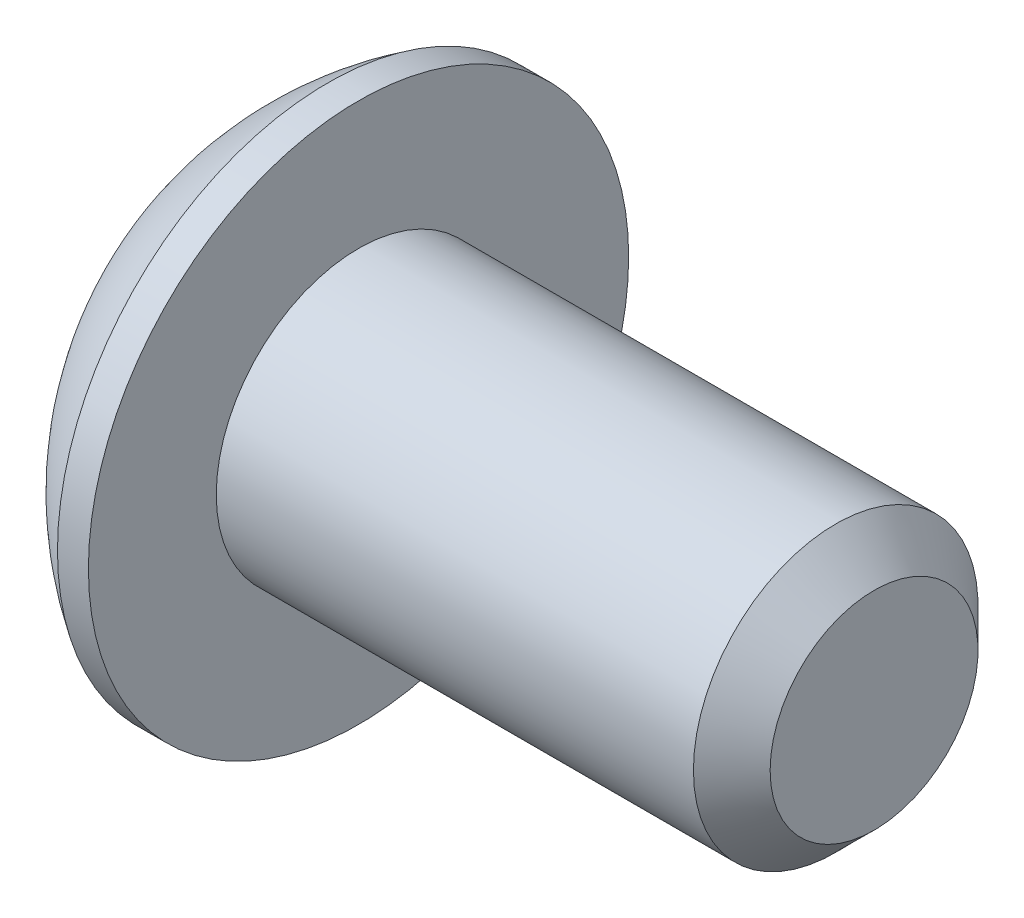
ISO-10303-21;
HEADER;
FILE_DESCRIPTION(('STEP AP214'),'2;1');
FILE_NAME('part.step','',(''),(''),'','','');
FILE_SCHEMA(('AUTOMOTIVE_DESIGN { 1 0 10303 214 1 1 1 1 }'));
ENDSEC;
DATA;
#1=APPLICATION_CONTEXT('core data for automotive mechanical design processes');
#2=APPLICATION_PROTOCOL_DEFINITION('international standard','automotive_design',2000,#1);
#3=PRODUCT_CONTEXT('',#1,'mechanical');
#4=PRODUCT('Part','Part','',(#3));
#5=PRODUCT_RELATED_PRODUCT_CATEGORY('part','',(#4));
#6=PRODUCT_DEFINITION_FORMATION('','',#4);
#7=PRODUCT_DEFINITION_CONTEXT('part definition',#1,'design');
#8=PRODUCT_DEFINITION('design','',#6,#7);
#9=PRODUCT_DEFINITION_SHAPE('','',#8);
#10=(LENGTH_UNIT() NAMED_UNIT(*) SI_UNIT(.MILLI.,.METRE.));
#11=(NAMED_UNIT(*) PLANE_ANGLE_UNIT() SI_UNIT($,.RADIAN.));
#12=(NAMED_UNIT(*) SI_UNIT($,.STERADIAN.) SOLID_ANGLE_UNIT());
#13=UNCERTAINTY_MEASURE_WITH_UNIT(LENGTH_MEASURE(1.E-05),#10,'distance_accuracy_value','');
#14=(GEOMETRIC_REPRESENTATION_CONTEXT(3) GLOBAL_UNCERTAINTY_ASSIGNED_CONTEXT((#13)) GLOBAL_UNIT_ASSIGNED_CONTEXT((#10,
#11,#12)) REPRESENTATION_CONTEXT('',''));
#15=CARTESIAN_POINT('',(0.,0.,0.));
#16=DIRECTION('',(0.,0.,1.));
#17=DIRECTION('',(1.,0.,0.));
#18=AXIS2_PLACEMENT_3D('',#15,#16,#17);
#19=CARTESIAN_POINT('',(0.,0.,0.));
#20=DIRECTION('',(-1.,0.,0.));
#21=DIRECTION('',(0.,0.,1.));
#22=AXIS2_PLACEMENT_3D('',#19,#20,#21);
#23=PLANE('',#22);
#24=CARTESIAN_POINT('',(0.,0.,0.));
#25=DIRECTION('',(-1.,0.,0.));
#26=DIRECTION('',(0.,0.,1.));
#27=AXIS2_PLACEMENT_3D('',#24,#25,#26);
#28=CIRCLE('',#27,1.6637);
#29=CARTESIAN_POINT('',(0.,0.,1.6637));
#30=VERTEX_POINT('',#29);
#31=EDGE_CURVE('E11',#30,#30,#28,.T.);
#32=ORIENTED_EDGE('',*,*,#31,.T.);
#33=EDGE_LOOP('',(#32));
#34=FACE_BOUND('',#33,.T.);
#35=DIRECTION('',(0.,-1.,0.));
#36=VECTOR('',#35,1.);
#37=CARTESIAN_POINT('',(0.,-0.571923176659242,0.9906));
#38=LINE('',#37,#36);
#39=CARTESIAN_POINT('',(0.,0.571923176659244,0.9906));
#40=VERTEX_POINT('',#39);
#41=CARTESIAN_POINT('',(0.,-0.571923176659242,0.9906));
#42=VERTEX_POINT('',#41);
#43=EDGE_CURVE('E52',#40,#42,#38,.T.);
#44=ORIENTED_EDGE('',*,*,#43,.T.);
#45=DIRECTION('',(0.,-0.5,-0.866025403784439));
#46=VECTOR('',#45,1.);
#47=CARTESIAN_POINT('',(0.,-1.14384635331849,0.));
#48=LINE('',#47,#46);
#49=CARTESIAN_POINT('',(0.,-1.14384635331849,0.));
#50=VERTEX_POINT('',#49);
#51=EDGE_CURVE('E375',#42,#50,#48,.T.);
#52=ORIENTED_EDGE('',*,*,#51,.T.);
#53=DIRECTION('',(0.,0.5,-0.866025403784439));
#54=VECTOR('',#53,1.);
#55=CARTESIAN_POINT('',(0.,-0.571923176659242,-0.9906));
#56=LINE('',#55,#54);
#57=CARTESIAN_POINT('',(0.,-0.571923176659242,-0.9906));
#58=VERTEX_POINT('',#57);
#59=EDGE_CURVE('E137',#50,#58,#56,.T.);
#60=ORIENTED_EDGE('',*,*,#59,.T.);
#61=DIRECTION('',(0.,1.,0.));
#62=VECTOR('',#61,1.);
#63=CARTESIAN_POINT('',(0.,0.571923176659244,-0.9906));
#64=LINE('',#63,#62);
#65=CARTESIAN_POINT('',(0.,0.571923176659244,-0.9906));
#66=VERTEX_POINT('',#65);
#67=EDGE_CURVE('E378',#58,#66,#64,.T.);
#68=ORIENTED_EDGE('',*,*,#67,.T.);
#69=DIRECTION('',(0.,0.5,0.866025403784439));
#70=VECTOR('',#69,1.);
#71=CARTESIAN_POINT('',(0.,1.14384635331849,0.));
#72=LINE('',#71,#70);
#73=CARTESIAN_POINT('',(0.,1.14384635331849,0.));
#74=VERTEX_POINT('',#73);
#75=EDGE_CURVE('E380',#66,#74,#72,.T.);
#76=ORIENTED_EDGE('',*,*,#75,.T.);
#77=DIRECTION('',(0.,-0.5,0.866025403784439));
#78=VECTOR('',#77,1.);
#79=CARTESIAN_POINT('',(0.,0.571923176659244,0.9906));
#80=LINE('',#79,#78);
#81=EDGE_CURVE('E382',#74,#40,#80,.T.);
#82=ORIENTED_EDGE('',*,*,#81,.T.);
#83=EDGE_LOOP('',(#44,#52,#60,#68,#76,#82));
#84=FACE_BOUND('',#83,.T.);
#85=ADVANCED_FACE('F38',(#34,#84),#23,.T.);
#86=CARTESIAN_POINT('',(3.55485043103449,0.,0.));
#87=DIRECTION('',(-1.,0.,0.));
#88=DIRECTION('',(0.,1.,0.));
#89=AXIS2_PLACEMENT_3D('',#86,#87,#88);
#90=SPHERICAL_SURFACE('',#89,3.92490245445999);
#91=CARTESIAN_POINT('',(1.4732,0.,0.));
#92=DIRECTION('',(-1.,0.,0.));
#93=DIRECTION('',(0.,0.,1.));
#94=AXIS2_PLACEMENT_3D('',#91,#92,#93);
#95=CIRCLE('',#94,3.3274);
#96=CARTESIAN_POINT('',(1.4732,0.,3.3274));
#97=VERTEX_POINT('',#96);
#98=EDGE_CURVE('E45',#97,#97,#95,.T.);
#99=ORIENTED_EDGE('',*,*,#98,.T.);
#100=EDGE_LOOP('',(#99));
#101=FACE_BOUND('',#100,.T.);
#102=ORIENTED_EDGE('',*,*,#31,.F.);
#103=EDGE_LOOP('',(#102));
#104=FACE_BOUND('',#103,.T.);
#105=ADVANCED_FACE('F164',(#101,#104),#90,.T.);
#106=CARTESIAN_POINT('',(0.,0.,0.));
#107=DIRECTION('',(-1.,0.,0.));
#108=DIRECTION('',(0.,0.,1.));
#109=AXIS2_PLACEMENT_3D('',#106,#107,#108);
#110=CYLINDRICAL_SURFACE('',#109,3.3274);
#111=ORIENTED_EDGE('',*,*,#98,.F.);
#112=EDGE_LOOP('',(#111));
#113=FACE_BOUND('',#112,.T.);
#114=CARTESIAN_POINT('',(1.8542,0.,0.));
#115=DIRECTION('',(-1.,0.,0.));
#116=DIRECTION('',(0.,0.,1.));
#117=AXIS2_PLACEMENT_3D('',#114,#115,#116);
#118=CIRCLE('',#117,3.3274);
#119=CARTESIAN_POINT('',(1.8542,0.,3.3274));
#120=VERTEX_POINT('',#119);
#121=EDGE_CURVE('E159',#120,#120,#118,.T.);
#122=ORIENTED_EDGE('',*,*,#121,.T.);
#123=EDGE_LOOP('',(#122));
#124=FACE_BOUND('',#123,.T.);
#125=ADVANCED_FACE('F167',(#113,#124),#110,.T.);
#126=CARTESIAN_POINT('',(1.8542,1.7526,0.));
#127=DIRECTION('',(-1.,0.,0.));
#128=DIRECTION('',(0.,0.,1.));
#129=AXIS2_PLACEMENT_3D('',#126,#127,#128);
#130=PLANE('',#129);
#131=ORIENTED_EDGE('',*,*,#121,.F.);
#132=EDGE_LOOP('',(#131));
#133=FACE_BOUND('',#132,.T.);
#134=CARTESIAN_POINT('',(1.8542,0.,0.));
#135=DIRECTION('',(-1.,0.,0.));
#136=DIRECTION('',(0.,0.,1.));
#137=AXIS2_PLACEMENT_3D('',#134,#135,#136);
#138=CIRCLE('',#137,1.7526);
#139=CARTESIAN_POINT('',(1.8542,0.,1.7526));
#140=VERTEX_POINT('',#139);
#141=EDGE_CURVE('E156',#140,#140,#138,.T.);
#142=ORIENTED_EDGE('',*,*,#141,.T.);
#143=EDGE_LOOP('',(#142));
#144=FACE_BOUND('',#143,.T.);
#145=ADVANCED_FACE('F170',(#133,#144),#130,.F.);
#146=CARTESIAN_POINT('',(0.,0.,0.));
#147=DIRECTION('',(-1.,0.,0.));
#148=DIRECTION('',(0.,0.,1.));
#149=AXIS2_PLACEMENT_3D('',#146,#147,#148);
#150=CYLINDRICAL_SURFACE('',#149,1.7526);
#151=ORIENTED_EDGE('',*,*,#141,.F.);
#152=EDGE_LOOP('',(#151));
#153=FACE_BOUND('',#152,.T.);
#154=CARTESIAN_POINT('',(7.73176,0.,0.));
#155=DIRECTION('',(-1.,0.,0.));
#156=DIRECTION('',(0.,0.,1.));
#157=AXIS2_PLACEMENT_3D('',#154,#155,#156);
#158=CIRCLE('',#157,1.7526);
#159=CARTESIAN_POINT('',(7.73176,0.,1.7526));
#160=VERTEX_POINT('',#159);
#161=EDGE_CURVE('E153',#160,#160,#158,.T.);
#162=ORIENTED_EDGE('',*,*,#161,.T.);
#163=EDGE_LOOP('',(#162));
#164=FACE_BOUND('',#163,.T.);
#165=ADVANCED_FACE('F176',(#153,#164),#150,.T.);
#166=CARTESIAN_POINT('',(8.2042,0.,0.));
#167=DIRECTION('',(-1.,0.,0.));
#168=DIRECTION('',(0.,0.,1.));
#169=AXIS2_PLACEMENT_3D('',#166,#167,#168);
#170=CONICAL_SURFACE('',#169,1.28016,0.785398163397447);
#171=ORIENTED_EDGE('',*,*,#161,.F.);
#172=EDGE_LOOP('',(#171));
#173=FACE_BOUND('',#172,.T.);
#174=CARTESIAN_POINT('',(8.2042,0.,0.));
#175=DIRECTION('',(-1.,0.,0.));
#176=DIRECTION('',(0.,0.,1.));
#177=AXIS2_PLACEMENT_3D('',#174,#175,#176);
#178=CIRCLE('',#177,1.28016);
#179=CARTESIAN_POINT('',(8.2042,0.,1.28016));
#180=VERTEX_POINT('',#179);
#181=EDGE_CURVE('E149',#180,#180,#178,.T.);
#182=ORIENTED_EDGE('',*,*,#181,.T.);
#183=EDGE_LOOP('',(#182));
#184=FACE_BOUND('',#183,.T.);
#185=ADVANCED_FACE('F182',(#173,#184),#170,.T.);
#186=CARTESIAN_POINT('',(8.2042,0.,0.));
#187=DIRECTION('',(-1.,0.,0.));
#188=DIRECTION('',(0.,0.,1.));
#189=AXIS2_PLACEMENT_3D('',#186,#187,#188);
#190=PLANE('',#189);
#191=ORIENTED_EDGE('',*,*,#181,.F.);
#192=EDGE_LOOP('',(#191));
#193=FACE_BOUND('',#192,.T.);
#194=ADVANCED_FACE('F188',(#193),#190,.F.);
#195=CARTESIAN_POINT('',(1.1176,-1.14384635331849,0.));
#196=DIRECTION('',(0.,0.866025403784439,-0.5));
#197=DIRECTION('',(0.,0.5,0.866025403784439));
#198=AXIS2_PLACEMENT_3D('',#195,#196,#197);
#199=PLANE('',#198);
#200=DIRECTION('',(0.,-0.5,-0.866025403784439));
#201=VECTOR('',#200,1.);
#202=CARTESIAN_POINT('',(1.1176,-1.14384635331849,0.));
#203=LINE('',#202,#201);
#204=CARTESIAN_POINT('',(1.1176,-0.571923176659242,0.9906));
#205=VERTEX_POINT('',#204);
#206=CARTESIAN_POINT('',(1.1176,-0.857884764988864,0.495299999999999));
#207=VERTEX_POINT('',#206);
#208=EDGE_CURVE('E120',#205,#207,#203,.T.);
#209=ORIENTED_EDGE('',*,*,#208,.T.);
#210=CARTESIAN_POINT('',(1.1176,-1.14384635331849,0.));
#211=VERTEX_POINT('',#210);
#212=EDGE_CURVE('E113',#207,#211,#203,.T.);
#213=ORIENTED_EDGE('',*,*,#212,.T.);
#214=DIRECTION('',(-1.,0.,0.));
#215=VECTOR('',#214,1.);
#216=CARTESIAN_POINT('',(1.1176,-1.14384635331849,0.));
#217=LINE('',#216,#215);
#218=EDGE_CURVE('E117',#211,#50,#217,.T.);
#219=ORIENTED_EDGE('',*,*,#218,.T.);
#220=ORIENTED_EDGE('',*,*,#51,.F.);
#221=DIRECTION('',(-1.,0.,0.));
#222=VECTOR('',#221,1.);
#223=CARTESIAN_POINT('',(1.1176,-0.571923176659242,0.9906));
#224=LINE('',#223,#222);
#225=EDGE_CURVE('E374',#205,#42,#224,.T.);
#226=ORIENTED_EDGE('',*,*,#225,.F.);
#227=EDGE_LOOP('',(#209,#213,#219,#220,#226));
#228=FACE_BOUND('',#227,.T.);
#229=ADVANCED_FACE('F115',(#228),#199,.T.);
#230=CARTESIAN_POINT('',(1.1176,-0.571923176659242,-0.9906));
#231=DIRECTION('',(0.,0.866025403784439,0.5));
#232=DIRECTION('',(0.,-0.5,0.866025403784439));
#233=AXIS2_PLACEMENT_3D('',#230,#231,#232);
#234=PLANE('',#233);
#235=DIRECTION('',(0.,0.5,-0.866025403784439));
#236=VECTOR('',#235,1.);
#237=CARTESIAN_POINT('',(1.1176,-0.571923176659242,-0.9906));
#238=LINE('',#237,#236);
#239=CARTESIAN_POINT('',(1.1176,-0.857884764988864,-0.495299999999999));
#240=VERTEX_POINT('',#239);
#241=EDGE_CURVE('E125',#211,#240,#238,.T.);
#242=ORIENTED_EDGE('',*,*,#241,.T.);
#243=CARTESIAN_POINT('',(1.1176,-0.571923176659242,-0.9906));
#244=VERTEX_POINT('',#243);
#245=EDGE_CURVE('E132',#240,#244,#238,.T.);
#246=ORIENTED_EDGE('',*,*,#245,.T.);
#247=DIRECTION('',(-1.,0.,0.));
#248=VECTOR('',#247,1.);
#249=CARTESIAN_POINT('',(1.1176,-0.571923176659242,-0.9906));
#250=LINE('',#249,#248);
#251=EDGE_CURVE('E139',#244,#58,#250,.T.);
#252=ORIENTED_EDGE('',*,*,#251,.T.);
#253=ORIENTED_EDGE('',*,*,#59,.F.);
#254=ORIENTED_EDGE('',*,*,#218,.F.);
#255=EDGE_LOOP('',(#242,#246,#252,#253,#254));
#256=FACE_BOUND('',#255,.T.);
#257=ADVANCED_FACE('F135',(#256),#234,.T.);
#258=CARTESIAN_POINT('',(1.1176,0.571923176659244,-0.9906));
#259=DIRECTION('',(0.,0.,1.));
#260=DIRECTION('',(1.,0.,0.));
#261=AXIS2_PLACEMENT_3D('',#258,#259,#260);
#262=PLANE('',#261);
#263=DIRECTION('',(0.,1.,0.));
#264=VECTOR('',#263,1.);
#265=CARTESIAN_POINT('',(1.1176,0.571923176659244,-0.9906));
#266=LINE('',#265,#264);
#267=CARTESIAN_POINT('',(1.1176,0.,-0.9906));
#268=VERTEX_POINT('',#267);
#269=EDGE_CURVE('E399',#244,#268,#266,.T.);
#270=ORIENTED_EDGE('',*,*,#269,.T.);
#271=CARTESIAN_POINT('',(1.1176,0.571923176659244,-0.9906));
#272=VERTEX_POINT('',#271);
#273=EDGE_CURVE('E131',#268,#272,#266,.T.);
#274=ORIENTED_EDGE('',*,*,#273,.T.);
#275=DIRECTION('',(-1.,0.,0.));
#276=VECTOR('',#275,1.);
#277=CARTESIAN_POINT('',(1.1176,0.571923176659244,-0.9906));
#278=LINE('',#277,#276);
#279=EDGE_CURVE('E144',#272,#66,#278,.T.);
#280=ORIENTED_EDGE('',*,*,#279,.T.);
#281=ORIENTED_EDGE('',*,*,#67,.F.);
#282=ORIENTED_EDGE('',*,*,#251,.F.);
#283=EDGE_LOOP('',(#270,#274,#280,#281,#282));
#284=FACE_BOUND('',#283,.T.);
#285=ADVANCED_FACE('F249',(#284),#262,.T.);
#286=CARTESIAN_POINT('',(1.1176,1.14384635331849,0.));
#287=DIRECTION('',(0.,-0.866025403784439,0.5));
#288=DIRECTION('',(0.,-0.5,-0.866025403784439));
#289=AXIS2_PLACEMENT_3D('',#286,#287,#288);
#290=PLANE('',#289);
#291=DIRECTION('',(0.,0.5,0.866025403784439));
#292=VECTOR('',#291,1.);
#293=CARTESIAN_POINT('',(1.1176,1.14384635331849,0.));
#294=LINE('',#293,#292);
#295=CARTESIAN_POINT('',(1.1176,0.857884764988865,-0.495300000000001));
#296=VERTEX_POINT('',#295);
#297=EDGE_CURVE('E361',#272,#296,#294,.T.);
#298=ORIENTED_EDGE('',*,*,#297,.T.);
#299=CARTESIAN_POINT('',(1.1176,1.14384635331849,0.));
#300=VERTEX_POINT('',#299);
#301=EDGE_CURVE('E401',#296,#300,#294,.T.);
#302=ORIENTED_EDGE('',*,*,#301,.T.);
#303=DIRECTION('',(-1.,0.,0.));
#304=VECTOR('',#303,1.);
#305=CARTESIAN_POINT('',(1.1176,1.14384635331849,0.));
#306=LINE('',#305,#304);
#307=EDGE_CURVE('E367',#300,#74,#306,.T.);
#308=ORIENTED_EDGE('',*,*,#307,.T.);
#309=ORIENTED_EDGE('',*,*,#75,.F.);
#310=ORIENTED_EDGE('',*,*,#279,.F.);
#311=EDGE_LOOP('',(#298,#302,#308,#309,#310));
#312=FACE_BOUND('',#311,.T.);
#313=ADVANCED_FACE('F258',(#312),#290,.T.);
#314=CARTESIAN_POINT('',(1.1176,0.571923176659244,0.9906));
#315=DIRECTION('',(0.,-0.866025403784439,-0.5));
#316=DIRECTION('',(0.,0.5,-0.866025403784439));
#317=AXIS2_PLACEMENT_3D('',#314,#315,#316);
#318=PLANE('',#317);
#319=DIRECTION('',(0.,-0.5,0.866025403784439));
#320=VECTOR('',#319,1.);
#321=CARTESIAN_POINT('',(1.1176,0.571923176659244,0.9906));
#322=LINE('',#321,#320);
#323=CARTESIAN_POINT('',(1.1176,0.857884764988865,0.4953));
#324=VERTEX_POINT('',#323);
#325=EDGE_CURVE('E360',#300,#324,#322,.T.);
#326=ORIENTED_EDGE('',*,*,#325,.T.);
#327=CARTESIAN_POINT('',(1.1176,0.571923176659244,0.9906));
#328=VERTEX_POINT('',#327);
#329=EDGE_CURVE('E357',#324,#328,#322,.T.);
#330=ORIENTED_EDGE('',*,*,#329,.T.);
#331=DIRECTION('',(-1.,0.,0.));
#332=VECTOR('',#331,1.);
#333=CARTESIAN_POINT('',(1.1176,0.571923176659244,0.9906));
#334=LINE('',#333,#332);
#335=EDGE_CURVE('E387',#328,#40,#334,.T.);
#336=ORIENTED_EDGE('',*,*,#335,.T.);
#337=ORIENTED_EDGE('',*,*,#81,.F.);
#338=ORIENTED_EDGE('',*,*,#307,.F.);
#339=EDGE_LOOP('',(#326,#330,#336,#337,#338));
#340=FACE_BOUND('',#339,.T.);
#341=ADVANCED_FACE('F268',(#340),#318,.T.);
#342=CARTESIAN_POINT('',(1.1176,-0.571923176659242,0.9906));
#343=DIRECTION('',(0.,0.,-1.));
#344=DIRECTION('',(-1.,0.,0.));
#345=AXIS2_PLACEMENT_3D('',#342,#343,#344);
#346=PLANE('',#345);
#347=DIRECTION('',(0.,-1.,0.));
#348=VECTOR('',#347,1.);
#349=CARTESIAN_POINT('',(1.1176,-0.571923176659242,0.9906));
#350=LINE('',#349,#348);
#351=CARTESIAN_POINT('',(1.1176,0.,0.9906));
#352=VERTEX_POINT('',#351);
#353=EDGE_CURVE('E60',#328,#352,#350,.T.);
#354=ORIENTED_EDGE('',*,*,#353,.T.);
#355=EDGE_CURVE('E369',#352,#205,#350,.T.);
#356=ORIENTED_EDGE('',*,*,#355,.T.);
#357=ORIENTED_EDGE('',*,*,#225,.T.);
#358=ORIENTED_EDGE('',*,*,#43,.F.);
#359=ORIENTED_EDGE('',*,*,#335,.F.);
#360=EDGE_LOOP('',(#354,#356,#357,#358,#359));
#361=FACE_BOUND('',#360,.T.);
#362=ADVANCED_FACE('F278',(#361),#346,.T.);
#363=CARTESIAN_POINT('',(1.1176,-0.571923176659242,0.9906));
#364=DIRECTION('',(-1.,0.,0.));
#365=DIRECTION('',(0.,0.,1.));
#366=AXIS2_PLACEMENT_3D('',#363,#364,#365);
#367=PLANE('',#366);
#368=ORIENTED_EDGE('',*,*,#353,.F.);
#369=ORIENTED_EDGE('',*,*,#329,.F.);
#370=CARTESIAN_POINT('',(1.1176,0.,0.));
#371=DIRECTION('',(-1.,0.,0.));
#372=DIRECTION('',(0.,0.,1.));
#373=AXIS2_PLACEMENT_3D('',#370,#371,#372);
#374=CIRCLE('',#373,0.9906);
#375=EDGE_CURVE('E143',#352,#324,#374,.T.);
#376=ORIENTED_EDGE('',*,*,#375,.F.);
#377=EDGE_LOOP('',(#368,#369,#376));
#378=FACE_BOUND('',#377,.T.);
#379=ADVANCED_FACE('F288',(#378),#367,.T.);
#380=ORIENTED_EDGE('',*,*,#325,.F.);
#381=ORIENTED_EDGE('',*,*,#301,.F.);
#382=EDGE_CURVE('E150',#324,#296,#374,.T.);
#383=ORIENTED_EDGE('',*,*,#382,.F.);
#384=EDGE_LOOP('',(#380,#381,#383));
#385=FACE_BOUND('',#384,.T.);
#386=ADVANCED_FACE('F297',(#385),#367,.T.);
#387=ORIENTED_EDGE('',*,*,#297,.F.);
#388=ORIENTED_EDGE('',*,*,#273,.F.);
#389=EDGE_CURVE('E402',#296,#268,#374,.T.);
#390=ORIENTED_EDGE('',*,*,#389,.F.);
#391=EDGE_LOOP('',(#387,#388,#390));
#392=FACE_BOUND('',#391,.T.);
#393=ADVANCED_FACE('F308',(#392),#367,.T.);
#394=ORIENTED_EDGE('',*,*,#269,.F.);
#395=ORIENTED_EDGE('',*,*,#245,.F.);
#396=EDGE_CURVE('E400',#268,#240,#374,.T.);
#397=ORIENTED_EDGE('',*,*,#396,.F.);
#398=EDGE_LOOP('',(#394,#395,#397));
#399=FACE_BOUND('',#398,.T.);
#400=ADVANCED_FACE('F317',(#399),#367,.T.);
#401=ORIENTED_EDGE('',*,*,#241,.F.);
#402=ORIENTED_EDGE('',*,*,#212,.F.);
#403=EDGE_CURVE('E127',#240,#207,#374,.T.);
#404=ORIENTED_EDGE('',*,*,#403,.F.);
#405=EDGE_LOOP('',(#401,#402,#404));
#406=FACE_BOUND('',#405,.T.);
#407=ADVANCED_FACE('F126',(#406),#367,.T.);
#408=ORIENTED_EDGE('',*,*,#208,.F.);
#409=ORIENTED_EDGE('',*,*,#355,.F.);
#410=EDGE_CURVE('E138',#207,#352,#374,.T.);
#411=ORIENTED_EDGE('',*,*,#410,.F.);
#412=EDGE_LOOP('',(#408,#409,#411));
#413=FACE_BOUND('',#412,.T.);
#414=ADVANCED_FACE('F300',(#413),#367,.T.);
#415=CARTESIAN_POINT('',(1.68952317665925,0.,0.));
#416=DIRECTION('',(-1.,0.,0.));
#417=DIRECTION('',(0.,0.,1.));
#418=AXIS2_PLACEMENT_3D('',#415,#416,#417);
#419=CONICAL_SURFACE('',#418,0.,1.04719755119659);
#420=ORIENTED_EDGE('',*,*,#375,.T.);
#421=ORIENTED_EDGE('',*,*,#382,.T.);
#422=ORIENTED_EDGE('',*,*,#389,.T.);
#423=ORIENTED_EDGE('',*,*,#396,.T.);
#424=ORIENTED_EDGE('',*,*,#403,.T.);
#425=ORIENTED_EDGE('',*,*,#410,.T.);
#426=EDGE_LOOP('',(#420,#421,#422,#423,#424,#425));
#427=FACE_BOUND('',#426,.T.);
#428=CARTESIAN_POINT('',(1.68952317665925,0.,0.));
#429=VERTEX_POINT('',#428);
#430=VERTEX_LOOP('',#429);
#431=FACE_BOUND('',#430,.T.);
#432=ADVANCED_FACE('F341',(#427,#431),#419,.F.);
#433=CLOSED_SHELL('',(#85,#105,#125,#145,#165,#185,#194,#229,#257,#285,#313,#341,#362,#379,#386,
#393,#400,#407,#414,#432));
#434=MANIFOLD_SOLID_BREP('B2',#433);
#435=ADVANCED_BREP_SHAPE_REPRESENTATION('',(#18,#434),#14);
#436=SHAPE_DEFINITION_REPRESENTATION(#9,#435);
ENDSEC;
END-ISO-10303-21;
